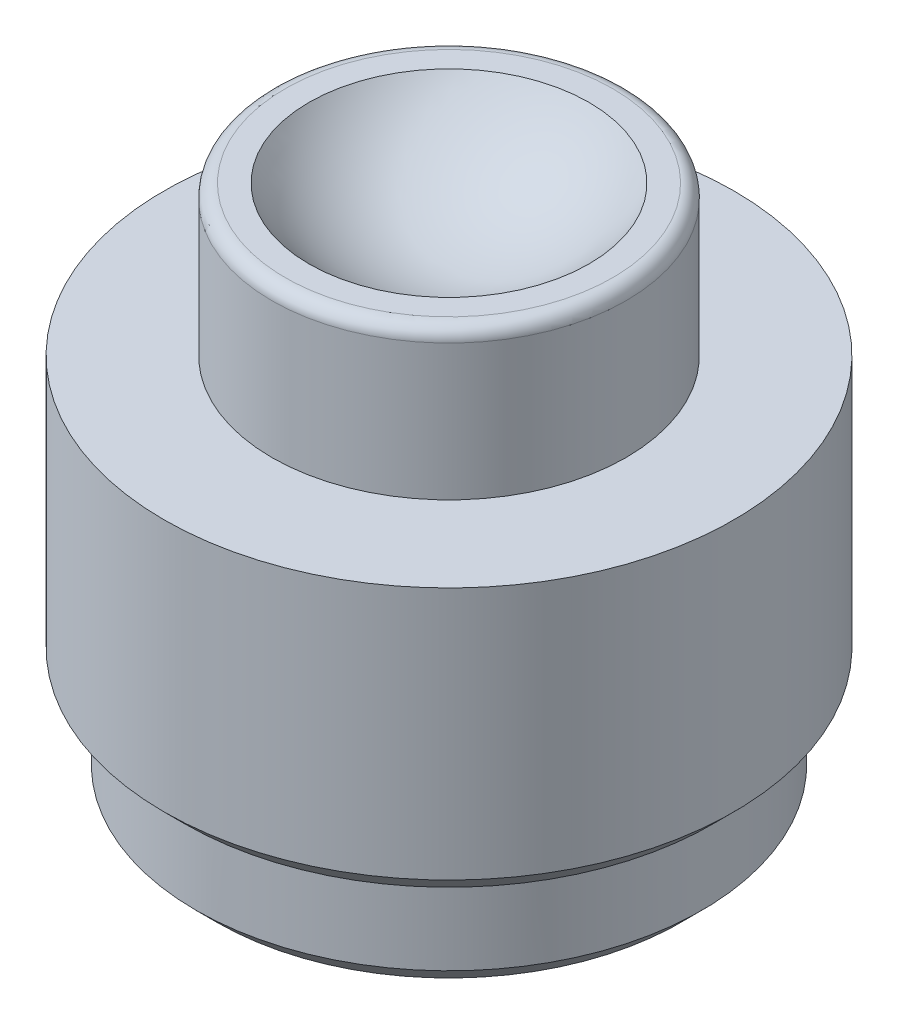
ISO-10303-21;
HEADER;
FILE_DESCRIPTION(('STEP AP214'),'2;1');
FILE_NAME('part.step','',(''),(''),'','','');
FILE_SCHEMA(('AUTOMOTIVE_DESIGN { 1 0 10303 214 1 1 1 1 }'));
ENDSEC;
DATA;
#1=APPLICATION_CONTEXT('core data for automotive mechanical design processes');
#2=APPLICATION_PROTOCOL_DEFINITION('international standard','automotive_design',2000,#1);
#3=PRODUCT_CONTEXT('',#1,'mechanical');
#4=PRODUCT('Part','Part','',(#3));
#5=PRODUCT_RELATED_PRODUCT_CATEGORY('part','',(#4));
#6=PRODUCT_DEFINITION_FORMATION('','',#4);
#7=PRODUCT_DEFINITION_CONTEXT('part definition',#1,'design');
#8=PRODUCT_DEFINITION('design','',#6,#7);
#9=PRODUCT_DEFINITION_SHAPE('','',#8);
#10=(LENGTH_UNIT() NAMED_UNIT(*) SI_UNIT(.MILLI.,.METRE.));
#11=(NAMED_UNIT(*) PLANE_ANGLE_UNIT() SI_UNIT($,.RADIAN.));
#12=(NAMED_UNIT(*) SI_UNIT($,.STERADIAN.) SOLID_ANGLE_UNIT());
#13=UNCERTAINTY_MEASURE_WITH_UNIT(LENGTH_MEASURE(1.E-05),#10,'distance_accuracy_value','');
#14=(GEOMETRIC_REPRESENTATION_CONTEXT(3) GLOBAL_UNCERTAINTY_ASSIGNED_CONTEXT((#13)) GLOBAL_UNIT_ASSIGNED_CONTEXT((#10,
#11,#12)) REPRESENTATION_CONTEXT('',''));
#15=CARTESIAN_POINT('',(0.,0.,0.));
#16=DIRECTION('',(0.,0.,1.));
#17=DIRECTION('',(1.,0.,0.));
#18=AXIS2_PLACEMENT_3D('',#15,#16,#17);
#19=CARTESIAN_POINT('',(-6.65,19.7,0.));
#20=DIRECTION('',(0.,-1.,0.));
#21=DIRECTION('',(0.,0.,-1.));
#22=AXIS2_PLACEMENT_3D('',#19,#20,#21);
#23=PLANE('',#22);
#24=CARTESIAN_POINT('',(0.,19.7,0.));
#25=DIRECTION('',(0.,-1.,0.));
#26=DIRECTION('',(0.,0.,-1.));
#27=AXIS2_PLACEMENT_3D('',#24,#25,#26);
#28=CIRCLE('',#27,6.15);
#29=CARTESIAN_POINT('',(0.,19.7,-6.15));
#30=VERTEX_POINT('',#29);
#31=EDGE_CURVE('E11',#30,#30,#28,.F.);
#32=ORIENTED_EDGE('',*,*,#31,.T.);
#33=EDGE_LOOP('',(#32));
#34=FACE_BOUND('',#33,.T.);
#35=CARTESIAN_POINT('',(0.,19.7,0.));
#36=DIRECTION('',(0.,-1.,0.));
#37=DIRECTION('',(0.,0.,-1.));
#38=AXIS2_PLACEMENT_3D('',#35,#36,#37);
#39=CIRCLE('',#38,5.25713800465615);
#40=CARTESIAN_POINT('',(0.,19.7,-5.25713800465615));
#41=VERTEX_POINT('',#40);
#42=EDGE_CURVE('E44',#41,#41,#39,.F.);
#43=ORIENTED_EDGE('',*,*,#42,.F.);
#44=EDGE_LOOP('',(#43));
#45=FACE_BOUND('',#44,.T.);
#46=ADVANCED_FACE('F17',(#34,#45),#23,.F.);
#47=CARTESIAN_POINT('',(0.,0.,0.));
#48=DIRECTION('',(0.,1.,0.));
#49=DIRECTION('',(0.,0.,1.));
#50=AXIS2_PLACEMENT_3D('',#47,#48,#49);
#51=PLANE('',#50);
#52=CARTESIAN_POINT('',(0.,0.,0.));
#53=DIRECTION('',(0.,-1.,0.));
#54=DIRECTION('',(0.,0.,-1.));
#55=AXIS2_PLACEMENT_3D('',#52,#53,#54);
#56=CIRCLE('',#55,2.5527);
#57=CARTESIAN_POINT('',(0.,0.,-2.5527));
#58=VERTEX_POINT('',#57);
#59=EDGE_CURVE('E38',#58,#58,#56,.T.);
#60=ORIENTED_EDGE('',*,*,#59,.F.);
#61=EDGE_LOOP('',(#60));
#62=FACE_BOUND('',#61,.T.);
#63=CARTESIAN_POINT('',(0.,0.,0.));
#64=DIRECTION('',(0.,1.,0.));
#65=DIRECTION('',(0.,0.,1.));
#66=AXIS2_PLACEMENT_3D('',#63,#64,#65);
#67=CIRCLE('',#66,8.7);
#68=CARTESIAN_POINT('',(0.,0.,8.7));
#69=VERTEX_POINT('',#68);
#70=EDGE_CURVE('E58',#69,#69,#67,.F.);
#71=ORIENTED_EDGE('',*,*,#70,.T.);
#72=EDGE_LOOP('',(#71));
#73=FACE_BOUND('',#72,.T.);
#74=ADVANCED_FACE('F82',(#62,#73),#51,.F.);
#75=CARTESIAN_POINT('',(0.,0.,0.));
#76=DIRECTION('',(0.,-1.,0.));
#77=DIRECTION('',(0.,0.,-1.));
#78=AXIS2_PLACEMENT_3D('',#75,#76,#77);
#79=CYLINDRICAL_SURFACE('',#78,9.5);
#80=CARTESIAN_POINT('',(0.,0.8,0.));
#81=DIRECTION('',(0.,1.,0.));
#82=DIRECTION('',(0.,0.,1.));
#83=AXIS2_PLACEMENT_3D('',#80,#81,#82);
#84=CIRCLE('',#83,9.5);
#85=CARTESIAN_POINT('',(0.,0.8,9.5));
#86=VERTEX_POINT('',#85);
#87=EDGE_CURVE('E61',#86,#86,#84,.T.);
#88=ORIENTED_EDGE('',*,*,#87,.T.);
#89=EDGE_LOOP('',(#88));
#90=FACE_BOUND('',#89,.T.);
#91=CARTESIAN_POINT('',(0.,3.8,0.));
#92=DIRECTION('',(0.,-1.,0.));
#93=DIRECTION('',(0.,0.,-1.));
#94=AXIS2_PLACEMENT_3D('',#91,#92,#93);
#95=CIRCLE('',#94,9.5);
#96=CARTESIAN_POINT('',(0.,3.8,-9.5));
#97=VERTEX_POINT('',#96);
#98=EDGE_CURVE('E49',#97,#97,#95,.T.);
#99=ORIENTED_EDGE('',*,*,#98,.T.);
#100=EDGE_LOOP('',(#99));
#101=FACE_BOUND('',#100,.T.);
#102=ADVANCED_FACE('F88',(#90,#101),#79,.T.);
#103=CARTESIAN_POINT('',(-9.5,3.8,0.));
#104=DIRECTION('',(0.,1.,0.));
#105=DIRECTION('',(0.,0.,1.));
#106=AXIS2_PLACEMENT_3D('',#103,#104,#105);
#107=PLANE('',#106);
#108=CARTESIAN_POINT('',(0.,3.8,0.));
#109=DIRECTION('',(0.,1.,0.));
#110=DIRECTION('',(0.,0.,1.));
#111=AXIS2_PLACEMENT_3D('',#108,#109,#110);
#112=CIRCLE('',#111,9.9);
#113=CARTESIAN_POINT('',(0.,3.8,9.9));
#114=VERTEX_POINT('',#113);
#115=EDGE_CURVE('E52',#114,#114,#112,.F.);
#116=ORIENTED_EDGE('',*,*,#115,.T.);
#117=EDGE_LOOP('',(#116));
#118=FACE_BOUND('',#117,.T.);
#119=ORIENTED_EDGE('',*,*,#98,.F.);
#120=EDGE_LOOP('',(#119));
#121=FACE_BOUND('',#120,.T.);
#122=ADVANCED_FACE('F104',(#118,#121),#107,.F.);
#123=CARTESIAN_POINT('',(0.,0.,0.));
#124=DIRECTION('',(0.,-1.,0.));
#125=DIRECTION('',(0.,0.,-1.));
#126=AXIS2_PLACEMENT_3D('',#123,#124,#125);
#127=CYLINDRICAL_SURFACE('',#126,10.7);
#128=CARTESIAN_POINT('',(0.,4.6,0.));
#129=DIRECTION('',(0.,1.,0.));
#130=DIRECTION('',(0.,0.,1.));
#131=AXIS2_PLACEMENT_3D('',#128,#129,#130);
#132=CIRCLE('',#131,10.7);
#133=CARTESIAN_POINT('',(0.,4.6,10.7));
#134=VERTEX_POINT('',#133);
#135=EDGE_CURVE('E55',#134,#134,#132,.T.);
#136=ORIENTED_EDGE('',*,*,#135,.T.);
#137=EDGE_LOOP('',(#136));
#138=FACE_BOUND('',#137,.T.);
#139=CARTESIAN_POINT('',(0.,14.1,0.));
#140=DIRECTION('',(0.,-1.,0.));
#141=DIRECTION('',(0.,0.,-1.));
#142=AXIS2_PLACEMENT_3D('',#139,#140,#141);
#143=CIRCLE('',#142,10.7);
#144=CARTESIAN_POINT('',(0.,14.1,-10.7));
#145=VERTEX_POINT('',#144);
#146=EDGE_CURVE('E41',#145,#145,#143,.T.);
#147=ORIENTED_EDGE('',*,*,#146,.T.);
#148=EDGE_LOOP('',(#147));
#149=FACE_BOUND('',#148,.T.);
#150=ADVANCED_FACE('F100',(#138,#149),#127,.T.);
#151=CARTESIAN_POINT('',(-10.7,14.1,0.));
#152=DIRECTION('',(0.,-1.,0.));
#153=DIRECTION('',(0.,0.,-1.));
#154=AXIS2_PLACEMENT_3D('',#151,#152,#153);
#155=PLANE('',#154);
#156=ORIENTED_EDGE('',*,*,#146,.F.);
#157=EDGE_LOOP('',(#156));
#158=FACE_BOUND('',#157,.T.);
#159=CARTESIAN_POINT('',(0.,14.1,0.));
#160=DIRECTION('',(0.,-1.,0.));
#161=DIRECTION('',(0.,0.,-1.));
#162=AXIS2_PLACEMENT_3D('',#159,#160,#161);
#163=CIRCLE('',#162,6.65);
#164=CARTESIAN_POINT('',(0.,14.1,-6.65));
#165=VERTEX_POINT('',#164);
#166=EDGE_CURVE('E37',#165,#165,#163,.T.);
#167=ORIENTED_EDGE('',*,*,#166,.T.);
#168=EDGE_LOOP('',(#167));
#169=FACE_BOUND('',#168,.T.);
#170=ADVANCED_FACE('F97',(#158,#169),#155,.F.);
#171=CARTESIAN_POINT('',(0.,0.,0.));
#172=DIRECTION('',(0.,-1.,0.));
#173=DIRECTION('',(0.,0.,-1.));
#174=AXIS2_PLACEMENT_3D('',#171,#172,#173);
#175=CYLINDRICAL_SURFACE('',#174,6.65);
#176=CARTESIAN_POINT('',(0.,19.2,0.));
#177=DIRECTION('',(0.,-1.,0.));
#178=DIRECTION('',(0.,0.,-1.));
#179=AXIS2_PLACEMENT_3D('',#176,#177,#178);
#180=CIRCLE('',#179,6.65);
#181=CARTESIAN_POINT('',(0.,19.2,-6.65));
#182=VERTEX_POINT('',#181);
#183=EDGE_CURVE('E24',#182,#182,#180,.T.);
#184=ORIENTED_EDGE('',*,*,#183,.T.);
#185=EDGE_LOOP('',(#184));
#186=FACE_BOUND('',#185,.T.);
#187=ORIENTED_EDGE('',*,*,#166,.F.);
#188=EDGE_LOOP('',(#187));
#189=FACE_BOUND('',#188,.T.);
#190=ADVANCED_FACE('F68',(#186,#189),#175,.T.);
#191=CARTESIAN_POINT('',(0.,3.8,0.));
#192=DIRECTION('',(0.,1.,0.));
#193=DIRECTION('',(0.,0.,1.));
#194=AXIS2_PLACEMENT_3D('',#191,#192,#193);
#195=CONICAL_SURFACE('',#194,9.9,0.785398163397448);
#196=ORIENTED_EDGE('',*,*,#135,.F.);
#197=EDGE_LOOP('',(#196));
#198=FACE_BOUND('',#197,.T.);
#199=ORIENTED_EDGE('',*,*,#115,.F.);
#200=EDGE_LOOP('',(#199));
#201=FACE_BOUND('',#200,.T.);
#202=ADVANCED_FACE('F96',(#198,#201),#195,.T.);
#203=CARTESIAN_POINT('',(0.,0.,0.));
#204=DIRECTION('',(0.,1.,0.));
#205=DIRECTION('',(0.,0.,1.));
#206=AXIS2_PLACEMENT_3D('',#203,#204,#205);
#207=CONICAL_SURFACE('',#206,8.7,0.785398163397445);
#208=ORIENTED_EDGE('',*,*,#87,.F.);
#209=EDGE_LOOP('',(#208));
#210=FACE_BOUND('',#209,.T.);
#211=ORIENTED_EDGE('',*,*,#70,.F.);
#212=EDGE_LOOP('',(#211));
#213=FACE_BOUND('',#212,.T.);
#214=ADVANCED_FACE('F31',(#210,#213),#207,.T.);
#215=CARTESIAN_POINT('',(0.,7.,0.));
#216=DIRECTION('',(0.,-1.,0.));
#217=DIRECTION('',(0.,0.,-1.));
#218=AXIS2_PLACEMENT_3D('',#215,#216,#217);
#219=CONICAL_SURFACE('',#218,2.5527,1.02974425867665);
#220=CARTESIAN_POINT('',(0.,8.53381690219165,0.));
#221=VERTEX_POINT('',#220);
#222=VERTEX_LOOP('',#221);
#223=FACE_BOUND('',#222,.T.);
#224=CARTESIAN_POINT('',(0.,7.,0.));
#225=DIRECTION('',(0.,-1.,0.));
#226=DIRECTION('',(0.,0.,-1.));
#227=AXIS2_PLACEMENT_3D('',#224,#225,#226);
#228=CIRCLE('',#227,2.5527);
#229=CARTESIAN_POINT('',(0.,7.,-2.5527));
#230=VERTEX_POINT('',#229);
#231=EDGE_CURVE('E35',#230,#230,#228,.T.);
#232=ORIENTED_EDGE('',*,*,#231,.T.);
#233=EDGE_LOOP('',(#232));
#234=FACE_BOUND('',#233,.T.);
#235=ADVANCED_FACE('F27',(#223,#234),#219,.F.);
#236=CARTESIAN_POINT('',(0.,0.,0.));
#237=DIRECTION('',(0.,-1.,0.));
#238=DIRECTION('',(0.,0.,-1.));
#239=AXIS2_PLACEMENT_3D('',#236,#237,#238);
#240=CYLINDRICAL_SURFACE('',#239,2.5527);
#241=ORIENTED_EDGE('',*,*,#231,.F.);
#242=EDGE_LOOP('',(#241));
#243=FACE_BOUND('',#242,.T.);
#244=ORIENTED_EDGE('',*,*,#59,.T.);
#245=EDGE_LOOP('',(#244));
#246=FACE_BOUND('',#245,.T.);
#247=ADVANCED_FACE('F30',(#243,#246),#240,.F.);
#248=CARTESIAN_POINT('',(0.,23.35,0.));
#249=DIRECTION('',(0.,-1.,0.));
#250=DIRECTION('',(-1.,0.,0.));
#251=AXIS2_PLACEMENT_3D('',#248,#249,#250);
#252=SPHERICAL_SURFACE('',#251,6.4);
#253=ORIENTED_EDGE('',*,*,#42,.T.);
#254=EDGE_LOOP('',(#253));
#255=FACE_BOUND('',#254,.T.);
#256=ADVANCED_FACE('F72',(#255),#252,.F.);
#257=CARTESIAN_POINT('',(0.,19.2,0.));
#258=DIRECTION('',(0.,-1.,0.));
#259=DIRECTION('',(0.,0.,-1.));
#260=AXIS2_PLACEMENT_3D('',#257,#258,#259);
#261=TOROIDAL_SURFACE('',#260,6.15,0.5);
#262=ORIENTED_EDGE('',*,*,#31,.F.);
#263=EDGE_LOOP('',(#262));
#264=FACE_BOUND('',#263,.T.);
#265=ORIENTED_EDGE('',*,*,#183,.F.);
#266=EDGE_LOOP('',(#265));
#267=FACE_BOUND('',#266,.T.);
#268=ADVANCED_FACE('F19',(#264,#267),#261,.T.);
#269=CLOSED_SHELL('',(#46,#74,#102,#122,#150,#170,#190,#202,#214,#235,#247,#256,#268));
#270=MANIFOLD_SOLID_BREP('B1',#269);
#271=ADVANCED_BREP_SHAPE_REPRESENTATION('',(#18,#270),#14);
#272=SHAPE_DEFINITION_REPRESENTATION(#9,#271);
ENDSEC;
END-ISO-10303-21;
